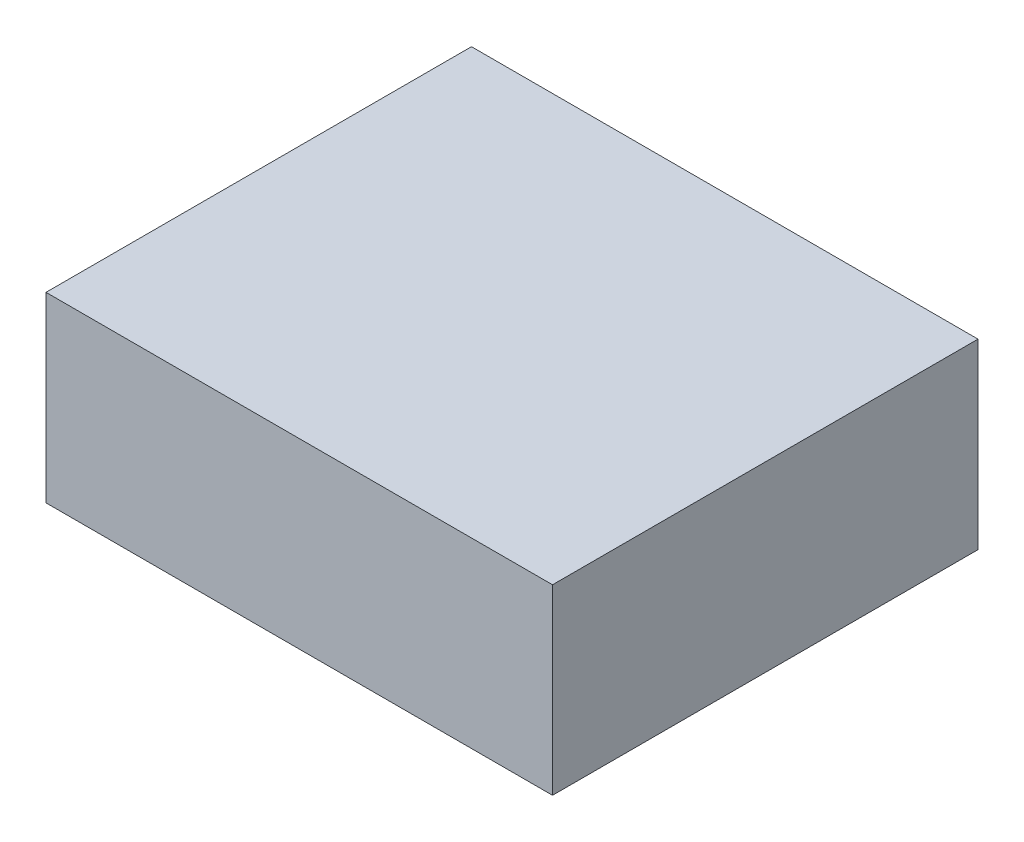
ISO-10303-21;
HEADER;
FILE_DESCRIPTION(('STEP AP214'),'2;1');
FILE_NAME('part.step','',(''),(''),'','','');
FILE_SCHEMA(('AUTOMOTIVE_DESIGN { 1 0 10303 214 1 1 1 1 }'));
ENDSEC;
DATA;
#1=APPLICATION_CONTEXT('core data for automotive mechanical design processes');
#2=APPLICATION_PROTOCOL_DEFINITION('international standard','automotive_design',2000,#1);
#3=PRODUCT_CONTEXT('',#1,'mechanical');
#4=PRODUCT('Part','Part','',(#3));
#5=PRODUCT_RELATED_PRODUCT_CATEGORY('part','',(#4));
#6=PRODUCT_DEFINITION_FORMATION('','',#4);
#7=PRODUCT_DEFINITION_CONTEXT('part definition',#1,'design');
#8=PRODUCT_DEFINITION('design','',#6,#7);
#9=PRODUCT_DEFINITION_SHAPE('','',#8);
#10=(LENGTH_UNIT() NAMED_UNIT(*) SI_UNIT(.MILLI.,.METRE.));
#11=(NAMED_UNIT(*) PLANE_ANGLE_UNIT() SI_UNIT($,.RADIAN.));
#12=(NAMED_UNIT(*) SI_UNIT($,.STERADIAN.) SOLID_ANGLE_UNIT());
#13=UNCERTAINTY_MEASURE_WITH_UNIT(LENGTH_MEASURE(1.E-05),#10,'distance_accuracy_value','');
#14=(GEOMETRIC_REPRESENTATION_CONTEXT(3) GLOBAL_UNCERTAINTY_ASSIGNED_CONTEXT((#13)) GLOBAL_UNIT_ASSIGNED_CONTEXT((#10,
#11,#12)) REPRESENTATION_CONTEXT('',''));
#15=CARTESIAN_POINT('',(0.,0.,0.));
#16=DIRECTION('',(0.,0.,1.));
#17=DIRECTION('',(1.,0.,0.));
#18=AXIS2_PLACEMENT_3D('',#15,#16,#17);
#19=CARTESIAN_POINT('',(12.5,-4.5,-10.5));
#20=DIRECTION('',(1.,0.,0.));
#21=DIRECTION('',(0.,0.,-1.));
#22=AXIS2_PLACEMENT_3D('',#19,#20,#21);
#23=PLANE('',#22);
#24=DIRECTION('',(0.,1.,0.));
#25=VECTOR('',#24,1.);
#26=CARTESIAN_POINT('',(12.5,-4.5,-10.5));
#27=LINE('',#26,#25);
#28=CARTESIAN_POINT('',(12.5,-4.5,-10.5));
#29=VERTEX_POINT('',#28);
#30=CARTESIAN_POINT('',(12.5,4.5,-10.5));
#31=VERTEX_POINT('',#30);
#32=EDGE_CURVE('E37',#29,#31,#27,.T.);
#33=ORIENTED_EDGE('',*,*,#32,.T.);
#34=DIRECTION('',(0.,0.,-1.));
#35=VECTOR('',#34,1.);
#36=CARTESIAN_POINT('',(12.5,4.5,-10.5));
#37=LINE('',#36,#35);
#38=CARTESIAN_POINT('',(12.5,4.5,10.5));
#39=VERTEX_POINT('',#38);
#40=EDGE_CURVE('E74',#39,#31,#37,.T.);
#41=ORIENTED_EDGE('',*,*,#40,.F.);
#42=DIRECTION('',(0.,1.,0.));
#43=VECTOR('',#42,1.);
#44=CARTESIAN_POINT('',(12.5,-4.5,10.5));
#45=LINE('',#44,#43);
#46=CARTESIAN_POINT('',(12.5,-4.5,10.5));
#47=VERTEX_POINT('',#46);
#48=EDGE_CURVE('E11',#47,#39,#45,.T.);
#49=ORIENTED_EDGE('',*,*,#48,.F.);
#50=DIRECTION('',(0.,0.,-1.));
#51=VECTOR('',#50,1.);
#52=CARTESIAN_POINT('',(12.5,-4.5,-10.5));
#53=LINE('',#52,#51);
#54=EDGE_CURVE('E75',#47,#29,#53,.T.);
#55=ORIENTED_EDGE('',*,*,#54,.T.);
#56=EDGE_LOOP('',(#33,#41,#49,#55));
#57=FACE_BOUND('',#56,.T.);
#58=ADVANCED_FACE('F34',(#57),#23,.T.);
#59=CARTESIAN_POINT('',(-12.5,-4.5,10.5));
#60=DIRECTION('',(0.,0.,1.));
#61=DIRECTION('',(1.,0.,0.));
#62=AXIS2_PLACEMENT_3D('',#59,#60,#61);
#63=PLANE('',#62);
#64=ORIENTED_EDGE('',*,*,#48,.T.);
#65=DIRECTION('',(1.,0.,0.));
#66=VECTOR('',#65,1.);
#67=CARTESIAN_POINT('',(-12.5,4.5,10.5));
#68=LINE('',#67,#66);
#69=CARTESIAN_POINT('',(-12.5,4.5,10.5));
#70=VERTEX_POINT('',#69);
#71=EDGE_CURVE('E91',#70,#39,#68,.T.);
#72=ORIENTED_EDGE('',*,*,#71,.F.);
#73=DIRECTION('',(0.,1.,0.));
#74=VECTOR('',#73,1.);
#75=CARTESIAN_POINT('',(-12.5,-4.5,10.5));
#76=LINE('',#75,#74);
#77=CARTESIAN_POINT('',(-12.5,-4.5,10.5));
#78=VERTEX_POINT('',#77);
#79=EDGE_CURVE('E42',#78,#70,#76,.T.);
#80=ORIENTED_EDGE('',*,*,#79,.F.);
#81=DIRECTION('',(1.,0.,0.));
#82=VECTOR('',#81,1.);
#83=CARTESIAN_POINT('',(-12.5,-4.5,10.5));
#84=LINE('',#83,#82);
#85=EDGE_CURVE('E80',#78,#47,#84,.T.);
#86=ORIENTED_EDGE('',*,*,#85,.T.);
#87=EDGE_LOOP('',(#64,#72,#80,#86));
#88=FACE_BOUND('',#87,.T.);
#89=ADVANCED_FACE('F106',(#88),#63,.T.);
#90=CARTESIAN_POINT('',(-12.5,-4.5,-10.5));
#91=DIRECTION('',(-1.,0.,0.));
#92=DIRECTION('',(0.,0.,1.));
#93=AXIS2_PLACEMENT_3D('',#90,#91,#92);
#94=PLANE('',#93);
#95=ORIENTED_EDGE('',*,*,#79,.T.);
#96=DIRECTION('',(0.,0.,1.));
#97=VECTOR('',#96,1.);
#98=CARTESIAN_POINT('',(-12.5,4.5,-10.5));
#99=LINE('',#98,#97);
#100=CARTESIAN_POINT('',(-12.5,4.5,-10.5));
#101=VERTEX_POINT('',#100);
#102=EDGE_CURVE('E87',#101,#70,#99,.T.);
#103=ORIENTED_EDGE('',*,*,#102,.F.);
#104=DIRECTION('',(0.,1.,0.));
#105=VECTOR('',#104,1.);
#106=CARTESIAN_POINT('',(-12.5,-4.5,-10.5));
#107=LINE('',#106,#105);
#108=CARTESIAN_POINT('',(-12.5,-4.5,-10.5));
#109=VERTEX_POINT('',#108);
#110=EDGE_CURVE('E79',#109,#101,#107,.T.);
#111=ORIENTED_EDGE('',*,*,#110,.F.);
#112=DIRECTION('',(0.,0.,1.));
#113=VECTOR('',#112,1.);
#114=CARTESIAN_POINT('',(-12.5,-4.5,-10.5));
#115=LINE('',#114,#113);
#116=EDGE_CURVE('E99',#109,#78,#115,.T.);
#117=ORIENTED_EDGE('',*,*,#116,.T.);
#118=EDGE_LOOP('',(#95,#103,#111,#117));
#119=FACE_BOUND('',#118,.T.);
#120=ADVANCED_FACE('F103',(#119),#94,.T.);
#121=CARTESIAN_POINT('',(-12.5,-4.5,-10.5));
#122=DIRECTION('',(0.,0.,-1.));
#123=DIRECTION('',(-1.,0.,0.));
#124=AXIS2_PLACEMENT_3D('',#121,#122,#123);
#125=PLANE('',#124);
#126=ORIENTED_EDGE('',*,*,#110,.T.);
#127=DIRECTION('',(-1.,0.,0.));
#128=VECTOR('',#127,1.);
#129=CARTESIAN_POINT('',(-12.5,4.5,-10.5));
#130=LINE('',#129,#128);
#131=EDGE_CURVE('E82',#31,#101,#130,.T.);
#132=ORIENTED_EDGE('',*,*,#131,.F.);
#133=ORIENTED_EDGE('',*,*,#32,.F.);
#134=DIRECTION('',(-1.,0.,0.));
#135=VECTOR('',#134,1.);
#136=CARTESIAN_POINT('',(-12.5,-4.5,-10.5));
#137=LINE('',#136,#135);
#138=EDGE_CURVE('E97',#29,#109,#137,.T.);
#139=ORIENTED_EDGE('',*,*,#138,.T.);
#140=EDGE_LOOP('',(#126,#132,#133,#139));
#141=FACE_BOUND('',#140,.T.);
#142=ADVANCED_FACE('F83',(#141),#125,.T.);
#143=CARTESIAN_POINT('',(0.,-4.5,0.));
#144=DIRECTION('',(0.,1.,0.));
#145=DIRECTION('',(0.,0.,1.));
#146=AXIS2_PLACEMENT_3D('',#143,#144,#145);
#147=PLANE('',#146);
#148=ORIENTED_EDGE('',*,*,#54,.F.);
#149=ORIENTED_EDGE('',*,*,#85,.F.);
#150=ORIENTED_EDGE('',*,*,#116,.F.);
#151=ORIENTED_EDGE('',*,*,#138,.F.);
#152=EDGE_LOOP('',(#148,#149,#150,#151));
#153=FACE_BOUND('',#152,.T.);
#154=ADVANCED_FACE('F108',(#153),#147,.F.);
#155=CARTESIAN_POINT('',(0.,4.5,0.));
#156=DIRECTION('',(0.,1.,0.));
#157=DIRECTION('',(0.,0.,1.));
#158=AXIS2_PLACEMENT_3D('',#155,#156,#157);
#159=PLANE('',#158);
#160=ORIENTED_EDGE('',*,*,#40,.T.);
#161=ORIENTED_EDGE('',*,*,#131,.T.);
#162=ORIENTED_EDGE('',*,*,#102,.T.);
#163=ORIENTED_EDGE('',*,*,#71,.T.);
#164=EDGE_LOOP('',(#160,#161,#162,#163));
#165=FACE_BOUND('',#164,.T.);
#166=ADVANCED_FACE('F90',(#165),#159,.T.);
#167=CLOSED_SHELL('',(#58,#89,#120,#142,#154,#166));
#168=MANIFOLD_SOLID_BREP('B2',#167);
#169=ADVANCED_BREP_SHAPE_REPRESENTATION('',(#18,#168),#14);
#170=SHAPE_DEFINITION_REPRESENTATION(#9,#169);
ENDSEC;
END-ISO-10303-21;
